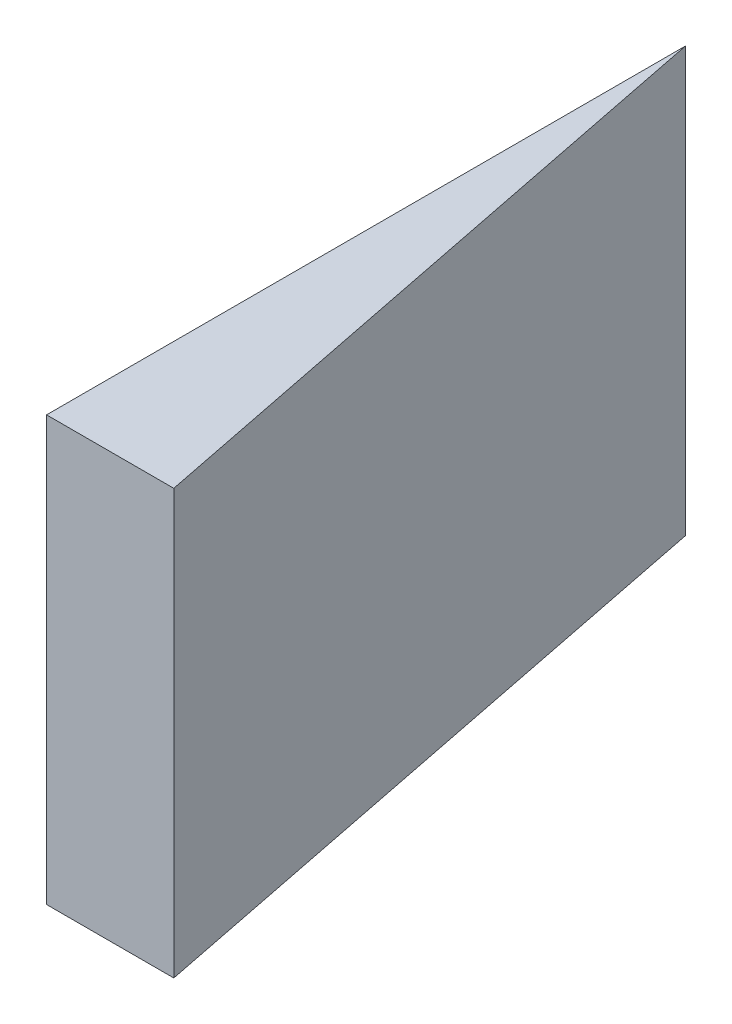
ISO-10303-21;
HEADER;
FILE_DESCRIPTION(('STEP AP214'),'2;1');
FILE_NAME('part.step','',(''),(''),'','','');
FILE_SCHEMA(('AUTOMOTIVE_DESIGN { 1 0 10303 214 1 1 1 1 }'));
ENDSEC;
DATA;
#1=APPLICATION_CONTEXT('core data for automotive mechanical design processes');
#2=APPLICATION_PROTOCOL_DEFINITION('international standard','automotive_design',2000,#1);
#3=PRODUCT_CONTEXT('',#1,'mechanical');
#4=PRODUCT('Part','Part','',(#3));
#5=PRODUCT_RELATED_PRODUCT_CATEGORY('part','',(#4));
#6=PRODUCT_DEFINITION_FORMATION('','',#4);
#7=PRODUCT_DEFINITION_CONTEXT('part definition',#1,'design');
#8=PRODUCT_DEFINITION('design','',#6,#7);
#9=PRODUCT_DEFINITION_SHAPE('','',#8);
#10=(LENGTH_UNIT() NAMED_UNIT(*) SI_UNIT(.MILLI.,.METRE.));
#11=(NAMED_UNIT(*) PLANE_ANGLE_UNIT() SI_UNIT($,.RADIAN.));
#12=(NAMED_UNIT(*) SI_UNIT($,.STERADIAN.) SOLID_ANGLE_UNIT());
#13=UNCERTAINTY_MEASURE_WITH_UNIT(LENGTH_MEASURE(1.E-05),#10,'distance_accuracy_value','');
#14=(GEOMETRIC_REPRESENTATION_CONTEXT(3) GLOBAL_UNCERTAINTY_ASSIGNED_CONTEXT((#13)) GLOBAL_UNIT_ASSIGNED_CONTEXT((#10,
#11,#12)) REPRESENTATION_CONTEXT('',''));
#15=CARTESIAN_POINT('',(0.,0.,0.));
#16=DIRECTION('',(0.,0.,1.));
#17=DIRECTION('',(1.,0.,0.));
#18=AXIS2_PLACEMENT_3D('',#15,#16,#17);
#19=CARTESIAN_POINT('',(3.37532201228972,1.74999945514535,-5.23287750649393));
#20=DIRECTION('',(1.74845553146952E-07,1.,-8.74227765734759E-08));
#21=DIRECTION('',(-1.,1.74845553146952E-07,0.));
#22=AXIS2_PLACEMENT_3D('',#19,#20,#21);
#23=PLANE('',#22);
#24=DIRECTION('',(-0.195310522456626,-5.15899645913099E-08,-0.980741454114038));
#25=VECTOR('',#24,1.);
#26=CARTESIAN_POINT('',(3.30000030597973,1.74999960659651,-3.65112167398593));
#27=LINE('',#26,#25);
#28=CARTESIAN_POINT('',(3.30000030597973,1.74999960659551,-3.65112167398693));
#29=VERTEX_POINT('',#28);
#30=CARTESIAN_POINT('',(3.00000030597972,1.74999952735252,-5.15755580018293));
#31=VERTEX_POINT('',#30);
#32=EDGE_CURVE('E11',#29,#31,#27,.T.);
#33=ORIENTED_EDGE('',*,*,#32,.T.);
#34=DIRECTION('',(0.,8.74227765663743E-08,0.999999999999996));
#35=VECTOR('',#34,1.);
#36=CARTESIAN_POINT('',(3.00000030597972,1.74999952735352,-5.15755580018393));
#37=LINE('',#36,#35);
#38=CARTESIAN_POINT('',(3.00000030597973,1.74999965904917,-3.65112167398593));
#39=VERTEX_POINT('',#38);
#40=EDGE_CURVE('E49',#31,#39,#37,.T.);
#41=ORIENTED_EDGE('',*,*,#40,.T.);
#42=DIRECTION('',(0.999999999999985,-1.74845553591038E-07,0.));
#43=VECTOR('',#42,1.);
#44=CARTESIAN_POINT('',(3.00000030597973,1.74999965905017,-3.65112167398593));
#45=LINE('',#44,#43);
#46=EDGE_CURVE('E47',#39,#29,#45,.T.);
#47=ORIENTED_EDGE('',*,*,#46,.T.);
#48=EDGE_LOOP('',(#33,#41,#47));
#49=FACE_BOUND('',#48,.T.);
#50=ADVANCED_FACE('F17',(#49),#23,.T.);
#51=CARTESIAN_POINT('',(3.37532183744417,0.749999455145353,-5.23287741907115));
#52=DIRECTION('',(1.74845553146952E-07,1.,-8.74227765734759E-08));
#53=DIRECTION('',(-1.,1.74845553146952E-07,0.));
#54=AXIS2_PLACEMENT_3D('',#51,#52,#53);
#55=PLANE('',#54);
#56=DIRECTION('',(0.999999999999985,-1.7484555285089E-07,0.));
#57=VECTOR('',#56,1.);
#58=CARTESIAN_POINT('',(3.00000013113418,0.749999659050171,-3.65112158656315));
#59=LINE('',#58,#57);
#60=CARTESIAN_POINT('',(3.00000013113418,0.749999659051171,-3.65112158656315));
#61=VERTEX_POINT('',#60);
#62=CARTESIAN_POINT('',(3.30000013113418,0.749999606597505,-3.65112158656415));
#63=VERTEX_POINT('',#62);
#64=EDGE_CURVE('E24',#61,#63,#59,.T.);
#65=ORIENTED_EDGE('',*,*,#64,.F.);
#66=DIRECTION('',(0.,8.74227765663743E-08,0.999999999999996));
#67=VECTOR('',#66,1.);
#68=CARTESIAN_POINT('',(3.00000013113417,0.749999527353517,-5.15755571276115));
#69=LINE('',#68,#67);
#70=CARTESIAN_POINT('',(3.00000013113417,0.749999527354517,-5.15755571276015));
#71=VERTEX_POINT('',#70);
#72=EDGE_CURVE('E53',#71,#61,#69,.T.);
#73=ORIENTED_EDGE('',*,*,#72,.F.);
#74=DIRECTION('',(-0.195310522456626,-5.15899647358687E-08,-0.980741454114038));
#75=VECTOR('',#74,1.);
#76=CARTESIAN_POINT('',(3.30000013113418,0.749999606596506,-3.65112158656315));
#77=LINE('',#76,#75);
#78=EDGE_CURVE('E68',#63,#71,#77,.T.);
#79=ORIENTED_EDGE('',*,*,#78,.F.);
#80=EDGE_LOOP('',(#65,#73,#79));
#81=FACE_BOUND('',#80,.T.);
#82=ADVANCED_FACE('F73',(#81),#55,.F.);
#83=CARTESIAN_POINT('',(3.30000030597973,1.74999960659651,-3.65112167398593));
#84=DIRECTION('',(-0.980741454114039,1.8855287018374E-07,0.195310522456612));
#85=DIRECTION('',(-0.195310522456627,-5.15899646850099E-08,-0.980741454114042));
#86=AXIS2_PLACEMENT_3D('',#83,#84,#85);
#87=PLANE('',#86);
#88=DIRECTION('',(-1.74845553146948E-07,-0.999999999999981,8.74227765734742E-08));
#89=VECTOR('',#88,1.);
#90=CARTESIAN_POINT('',(3.30000030597973,1.74999960659651,-3.65112167398593));
#91=LINE('',#90,#89);
#92=EDGE_CURVE('E59',#29,#63,#91,.T.);
#93=ORIENTED_EDGE('',*,*,#92,.T.);
#94=ORIENTED_EDGE('',*,*,#78,.T.);
#95=DIRECTION('',(-1.74845553146948E-07,-0.999999999999981,8.74227765734742E-08));
#96=VECTOR('',#95,1.);
#97=CARTESIAN_POINT('',(3.00000030597972,1.74999952735352,-5.15755580018393));
#98=LINE('',#97,#96);
#99=EDGE_CURVE('E54',#31,#71,#98,.T.);
#100=ORIENTED_EDGE('',*,*,#99,.F.);
#101=ORIENTED_EDGE('',*,*,#32,.F.);
#102=EDGE_LOOP('',(#93,#94,#100,#101));
#103=FACE_BOUND('',#102,.T.);
#104=ADVANCED_FACE('F57',(#103),#87,.F.);
#105=CARTESIAN_POINT('',(3.00000030597972,1.74999952735352,-5.15755580018393));
#106=DIRECTION('',(1.,-1.74845553146952E-07,0.));
#107=DIRECTION('',(0.,8.74227765734759E-08,1.));
#108=AXIS2_PLACEMENT_3D('',#105,#106,#107);
#109=PLANE('',#108);
#110=ORIENTED_EDGE('',*,*,#99,.T.);
#111=ORIENTED_EDGE('',*,*,#72,.T.);
#112=DIRECTION('',(-1.74845553146948E-07,-0.999999999999981,8.74227765734742E-08));
#113=VECTOR('',#112,1.);
#114=CARTESIAN_POINT('',(3.00000030597973,1.74999965905017,-3.65112167398593));
#115=LINE('',#114,#113);
#116=EDGE_CURVE('E70',#39,#61,#115,.T.);
#117=ORIENTED_EDGE('',*,*,#116,.F.);
#118=ORIENTED_EDGE('',*,*,#40,.F.);
#119=EDGE_LOOP('',(#110,#111,#117,#118));
#120=FACE_BOUND('',#119,.T.);
#121=ADVANCED_FACE('F72',(#120),#109,.F.);
#122=CARTESIAN_POINT('',(3.00000030597973,1.74999965905017,-3.65112167398593));
#123=DIRECTION('',(0.,-8.74227765734759E-08,-1.));
#124=DIRECTION('',(1.,-1.74845553146952E-07,0.));
#125=AXIS2_PLACEMENT_3D('',#122,#123,#124);
#126=PLANE('',#125);
#127=ORIENTED_EDGE('',*,*,#116,.T.);
#128=ORIENTED_EDGE('',*,*,#64,.T.);
#129=ORIENTED_EDGE('',*,*,#92,.F.);
#130=ORIENTED_EDGE('',*,*,#46,.F.);
#131=EDGE_LOOP('',(#127,#128,#129,#130));
#132=FACE_BOUND('',#131,.T.);
#133=ADVANCED_FACE('F61',(#132),#126,.F.);
#134=CLOSED_SHELL('',(#50,#82,#104,#121,#133));
#135=MANIFOLD_SOLID_BREP('B1',#134);
#136=ADVANCED_BREP_SHAPE_REPRESENTATION('',(#18,#135),#14);
#137=SHAPE_DEFINITION_REPRESENTATION(#9,#136);
ENDSEC;
END-ISO-10303-21;
